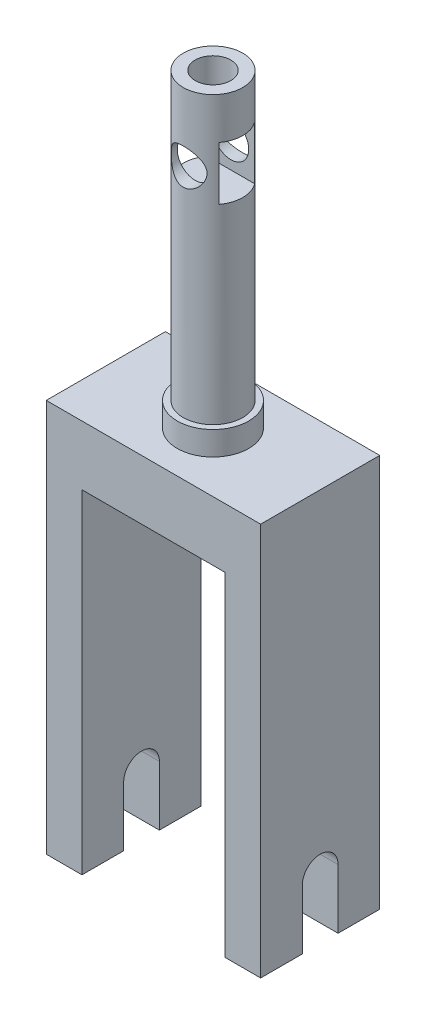
ISO-10303-21;
HEADER;
FILE_DESCRIPTION(('STEP AP214'),'2;1');
FILE_NAME('part.step','',(''),(''),'','','');
FILE_SCHEMA(('AUTOMOTIVE_DESIGN { 1 0 10303 214 1 1 1 1 }'));
ENDSEC;
DATA;
#1=APPLICATION_CONTEXT('core data for automotive mechanical design processes');
#2=APPLICATION_PROTOCOL_DEFINITION('international standard','automotive_design',2000,#1);
#3=PRODUCT_CONTEXT('',#1,'mechanical');
#4=PRODUCT('Part','Part','',(#3));
#5=PRODUCT_RELATED_PRODUCT_CATEGORY('part','',(#4));
#6=PRODUCT_DEFINITION_FORMATION('','',#4);
#7=PRODUCT_DEFINITION_CONTEXT('part definition',#1,'design');
#8=PRODUCT_DEFINITION('design','',#6,#7);
#9=PRODUCT_DEFINITION_SHAPE('','',#8);
#10=(LENGTH_UNIT() NAMED_UNIT(*) SI_UNIT(.MILLI.,.METRE.));
#11=(NAMED_UNIT(*) PLANE_ANGLE_UNIT() SI_UNIT($,.RADIAN.));
#12=(NAMED_UNIT(*) SI_UNIT($,.STERADIAN.) SOLID_ANGLE_UNIT());
#13=UNCERTAINTY_MEASURE_WITH_UNIT(LENGTH_MEASURE(1.E-05),#10,'distance_accuracy_value','');
#14=(GEOMETRIC_REPRESENTATION_CONTEXT(3) GLOBAL_UNCERTAINTY_ASSIGNED_CONTEXT((#13)) GLOBAL_UNIT_ASSIGNED_CONTEXT((#10,
#11,#12)) REPRESENTATION_CONTEXT('',''));
#15=CARTESIAN_POINT('',(0.,0.,0.));
#16=DIRECTION('',(0.,0.,1.));
#17=DIRECTION('',(1.,0.,0.));
#18=AXIS2_PLACEMENT_3D('',#15,#16,#17);
#19=CARTESIAN_POINT('',(-15.,30.4132586688075,6.5));
#20=DIRECTION('',(0.,1.,0.));
#21=DIRECTION('',(0.,0.,1.));
#22=AXIS2_PLACEMENT_3D('',#19,#20,#21);
#23=PLANE('',#22);
#24=DIRECTION('',(1.,0.,0.));
#25=VECTOR('',#24,1.);
#26=CARTESIAN_POINT('',(-15.,30.4132586688075,6.5));
#27=LINE('',#26,#25);
#28=CARTESIAN_POINT('',(-6.,30.4132586688075,6.5));
#29=VERTEX_POINT('',#28);
#30=CARTESIAN_POINT('',(-4.00000000000001,30.4132586688075,6.5));
#31=VERTEX_POINT('',#30);
#32=EDGE_CURVE('E185',#29,#31,#27,.T.);
#33=ORIENTED_EDGE('',*,*,#32,.F.);
#34=CARTESIAN_POINT('',(-6.,30.4132586688075,5.));
#35=DIRECTION('',(0.,1.,0.));
#36=DIRECTION('',(0.,0.,1.));
#37=AXIS2_PLACEMENT_3D('',#34,#35,#36);
#38=CIRCLE('',#37,1.5);
#39=CARTESIAN_POINT('',(-6.,30.4132586688075,3.5));
#40=VERTEX_POINT('',#39);
#41=EDGE_CURVE('E47',#40,#29,#38,.F.);
#42=ORIENTED_EDGE('',*,*,#41,.F.);
#43=DIRECTION('',(1.,0.,0.));
#44=VECTOR('',#43,1.);
#45=CARTESIAN_POINT('',(-15.,30.4132586688075,3.5));
#46=LINE('',#45,#44);
#47=CARTESIAN_POINT('',(-4.,30.4132586688075,3.5));
#48=VERTEX_POINT('',#47);
#49=EDGE_CURVE('E183',#40,#48,#46,.T.);
#50=ORIENTED_EDGE('',*,*,#49,.T.);
#51=CARTESIAN_POINT('',(-6.,30.4132586688075,5.));
#52=DIRECTION('',(0.,1.,0.));
#53=DIRECTION('',(0.,0.,1.));
#54=AXIS2_PLACEMENT_3D('',#51,#52,#53);
#55=CIRCLE('',#54,2.5);
#56=EDGE_CURVE('E41',#31,#48,#55,.T.);
#57=ORIENTED_EDGE('',*,*,#56,.F.);
#58=EDGE_LOOP('',(#33,#42,#50,#57));
#59=FACE_BOUND('',#58,.T.);
#60=ADVANCED_FACE('F32',(#59),#23,.F.);
#61=CARTESIAN_POINT('',(-6.,9.91325866880753,5.));
#62=DIRECTION('',(0.,1.,0.));
#63=DIRECTION('',(0.,0.,1.));
#64=AXIS2_PLACEMENT_3D('',#61,#62,#63);
#65=PLANE('',#64);
#66=CARTESIAN_POINT('',(-6.,9.91325866880753,5.));
#67=DIRECTION('',(0.,1.,0.));
#68=DIRECTION('',(0.,0.,1.));
#69=AXIS2_PLACEMENT_3D('',#66,#67,#68);
#70=CIRCLE('',#69,3.);
#71=CARTESIAN_POINT('',(-6.,9.91325866880753,8.));
#72=VERTEX_POINT('',#71);
#73=EDGE_CURVE('E211',#72,#72,#70,.T.);
#74=ORIENTED_EDGE('',*,*,#73,.T.);
#75=EDGE_LOOP('',(#74));
#76=FACE_BOUND('',#75,.T.);
#77=CARTESIAN_POINT('',(-6.,9.91325866880753,5.));
#78=DIRECTION('',(0.,1.,0.));
#79=DIRECTION('',(0.,0.,1.));
#80=AXIS2_PLACEMENT_3D('',#77,#78,#79);
#81=CIRCLE('',#80,2.5);
#82=CARTESIAN_POINT('',(-6.,9.91325866880753,7.5));
#83=VERTEX_POINT('',#82);
#84=EDGE_CURVE('E212',#83,#83,#81,.T.);
#85=ORIENTED_EDGE('',*,*,#84,.F.);
#86=EDGE_LOOP('',(#85));
#87=FACE_BOUND('',#86,.T.);
#88=ADVANCED_FACE('F366',(#76,#87),#65,.T.);
#89=CARTESIAN_POINT('',(-15.,7.91325866880753,10.));
#90=DIRECTION('',(0.,-1.,0.));
#91=DIRECTION('',(0.,0.,-1.));
#92=AXIS2_PLACEMENT_3D('',#89,#90,#91);
#93=PLANE('',#92);
#94=DIRECTION('',(-1.,0.,0.));
#95=VECTOR('',#94,1.);
#96=CARTESIAN_POINT('',(-15.,7.91325866880753,0.));
#97=LINE('',#96,#95);
#98=CARTESIAN_POINT('',(3.,7.91325866880753,0.));
#99=VERTEX_POINT('',#98);
#100=CARTESIAN_POINT('',(-15.,7.91325866880753,0.));
#101=VERTEX_POINT('',#100);
#102=EDGE_CURVE('E300',#99,#101,#97,.T.);
#103=ORIENTED_EDGE('',*,*,#102,.T.);
#104=DIRECTION('',(0.,0.,-1.));
#105=VECTOR('',#104,1.);
#106=CARTESIAN_POINT('',(-15.,7.91325866880753,10.));
#107=LINE('',#106,#105);
#108=CARTESIAN_POINT('',(-15.,7.91325866880753,10.));
#109=VERTEX_POINT('',#108);
#110=EDGE_CURVE('E307',#109,#101,#107,.T.);
#111=ORIENTED_EDGE('',*,*,#110,.F.);
#112=DIRECTION('',(-1.,0.,0.));
#113=VECTOR('',#112,1.);
#114=CARTESIAN_POINT('',(-15.,7.91325866880753,10.));
#115=LINE('',#114,#113);
#116=CARTESIAN_POINT('',(3.,7.91325866880753,10.));
#117=VERTEX_POINT('',#116);
#118=EDGE_CURVE('E281',#117,#109,#115,.T.);
#119=ORIENTED_EDGE('',*,*,#118,.F.);
#120=DIRECTION('',(0.,0.,-1.));
#121=VECTOR('',#120,1.);
#122=CARTESIAN_POINT('',(3.,7.91325866880753,10.));
#123=LINE('',#122,#121);
#124=EDGE_CURVE('E310',#117,#99,#123,.T.);
#125=ORIENTED_EDGE('',*,*,#124,.T.);
#126=EDGE_LOOP('',(#103,#111,#119,#125));
#127=FACE_BOUND('',#126,.T.);
#128=CARTESIAN_POINT('',(-6.,7.91325866880753,5.));
#129=DIRECTION('',(0.,-1.,0.));
#130=DIRECTION('',(0.,0.,-1.));
#131=AXIS2_PLACEMENT_3D('',#128,#129,#130);
#132=CIRCLE('',#131,3.);
#133=CARTESIAN_POINT('',(-6.,7.91325866880753,2.));
#134=VERTEX_POINT('',#133);
#135=EDGE_CURVE('E331',#134,#134,#132,.F.);
#136=ORIENTED_EDGE('',*,*,#135,.F.);
#137=EDGE_LOOP('',(#136));
#138=FACE_BOUND('',#137,.T.);
#139=ADVANCED_FACE('F370',(#127,#138),#93,.F.);
#140=CARTESIAN_POINT('',(-12.,-25.0867413311925,10.));
#141=DIRECTION('',(0.,1.,0.));
#142=DIRECTION('',(-1.,0.,0.));
#143=AXIS2_PLACEMENT_3D('',#140,#141,#142);
#144=PLANE('',#143);
#145=DIRECTION('',(0.,0.,-1.));
#146=VECTOR('',#145,1.);
#147=CARTESIAN_POINT('',(-12.,-25.0867413311925,10.));
#148=LINE('',#147,#146);
#149=CARTESIAN_POINT('',(-12.,-25.0867413311925,3.5));
#150=VERTEX_POINT('',#149);
#151=CARTESIAN_POINT('',(-12.,-25.0867413311925,0.));
#152=VERTEX_POINT('',#151);
#153=EDGE_CURVE('E327',#150,#152,#148,.T.);
#154=ORIENTED_EDGE('',*,*,#153,.F.);
#155=DIRECTION('',(1.,0.,0.));
#156=VECTOR('',#155,1.);
#157=CARTESIAN_POINT('',(-15.,-25.0867413311925,3.5));
#158=LINE('',#157,#156);
#159=CARTESIAN_POINT('',(-15.,-25.0867413311925,3.5));
#160=VERTEX_POINT('',#159);
#161=EDGE_CURVE('E239',#160,#150,#158,.T.);
#162=ORIENTED_EDGE('',*,*,#161,.F.);
#163=DIRECTION('',(0.,0.,-1.));
#164=VECTOR('',#163,1.);
#165=CARTESIAN_POINT('',(-15.,-25.0867413311925,10.));
#166=LINE('',#165,#164);
#167=CARTESIAN_POINT('',(-15.,-25.0867413311925,0.));
#168=VERTEX_POINT('',#167);
#169=EDGE_CURVE('E285',#160,#168,#166,.T.);
#170=ORIENTED_EDGE('',*,*,#169,.T.);
#171=DIRECTION('',(1.,0.,0.));
#172=VECTOR('',#171,1.);
#173=CARTESIAN_POINT('',(-12.,-25.0867413311925,0.));
#174=LINE('',#173,#172);
#175=EDGE_CURVE('E266',#168,#152,#174,.T.);
#176=ORIENTED_EDGE('',*,*,#175,.T.);
#177=EDGE_LOOP('',(#154,#162,#170,#176));
#178=FACE_BOUND('',#177,.T.);
#179=ADVANCED_FACE('F446',(#178),#144,.F.);
#180=CARTESIAN_POINT('',(3.,-25.0867413311925,10.));
#181=DIRECTION('',(0.,1.,0.));
#182=DIRECTION('',(0.,0.,1.));
#183=AXIS2_PLACEMENT_3D('',#180,#181,#182);
#184=PLANE('',#183);
#185=DIRECTION('',(0.,0.,-1.));
#186=VECTOR('',#185,1.);
#187=CARTESIAN_POINT('',(3.,-25.0867413311925,10.));
#188=LINE('',#187,#186);
#189=CARTESIAN_POINT('',(3.,-25.0867413311925,3.5));
#190=VERTEX_POINT('',#189);
#191=CARTESIAN_POINT('',(3.,-25.0867413311925,0.));
#192=VERTEX_POINT('',#191);
#193=EDGE_CURVE('E313',#190,#192,#188,.T.);
#194=ORIENTED_EDGE('',*,*,#193,.F.);
#195=CARTESIAN_POINT('',(0.,-25.0867413311925,3.5));
#196=VERTEX_POINT('',#195);
#197=EDGE_CURVE('E241',#196,#190,#158,.T.);
#198=ORIENTED_EDGE('',*,*,#197,.F.);
#199=DIRECTION('',(0.,0.,-1.));
#200=VECTOR('',#199,1.);
#201=CARTESIAN_POINT('',(0.,-25.0867413311925,10.));
#202=LINE('',#201,#200);
#203=CARTESIAN_POINT('',(0.,-25.0867413311925,0.));
#204=VERTEX_POINT('',#203);
#205=EDGE_CURVE('E317',#196,#204,#202,.T.);
#206=ORIENTED_EDGE('',*,*,#205,.T.);
#207=DIRECTION('',(1.,0.,0.));
#208=VECTOR('',#207,1.);
#209=CARTESIAN_POINT('',(3.,-25.0867413311925,0.));
#210=LINE('',#209,#208);
#211=EDGE_CURVE('E295',#204,#192,#210,.T.);
#212=ORIENTED_EDGE('',*,*,#211,.T.);
#213=EDGE_LOOP('',(#194,#198,#206,#212));
#214=FACE_BOUND('',#213,.T.);
#215=ADVANCED_FACE('F456',(#214),#184,.F.);
#216=CARTESIAN_POINT('',(-15.,-25.0867413311925,10.));
#217=VERTEX_POINT('',#216);
#218=CARTESIAN_POINT('',(-15.,-25.0867413311925,6.5));
#219=VERTEX_POINT('',#218);
#220=EDGE_CURVE('E304',#217,#219,#166,.T.);
#221=ORIENTED_EDGE('',*,*,#220,.T.);
#222=DIRECTION('',(1.,0.,0.));
#223=VECTOR('',#222,1.);
#224=CARTESIAN_POINT('',(-15.,-25.0867413311925,6.5));
#225=LINE('',#224,#223);
#226=CARTESIAN_POINT('',(-12.,-25.0867413311925,6.5));
#227=VERTEX_POINT('',#226);
#228=EDGE_CURVE('E242',#219,#227,#225,.T.);
#229=ORIENTED_EDGE('',*,*,#228,.T.);
#230=CARTESIAN_POINT('',(-12.,-25.0867413311925,10.));
#231=VERTEX_POINT('',#230);
#232=EDGE_CURVE('E328',#231,#227,#148,.T.);
#233=ORIENTED_EDGE('',*,*,#232,.F.);
#234=DIRECTION('',(1.,0.,0.));
#235=VECTOR('',#234,1.);
#236=CARTESIAN_POINT('',(-12.,-25.0867413311925,10.));
#237=LINE('',#236,#235);
#238=EDGE_CURVE('E267',#217,#231,#237,.T.);
#239=ORIENTED_EDGE('',*,*,#238,.F.);
#240=EDGE_LOOP('',(#221,#229,#233,#239));
#241=FACE_BOUND('',#240,.T.);
#242=ADVANCED_FACE('F34',(#241),#144,.F.);
#243=CARTESIAN_POINT('',(-12.,2.91325866880752,10.));
#244=DIRECTION('',(-1.,0.,0.));
#245=DIRECTION('',(0.,-1.,0.));
#246=AXIS2_PLACEMENT_3D('',#243,#244,#245);
#247=PLANE('',#246);
#248=CARTESIAN_POINT('',(-12.,-20.0867413311925,5.));
#249=DIRECTION('',(-1.,0.,0.));
#250=DIRECTION('',(0.,-1.,0.));
#251=AXIS2_PLACEMENT_3D('',#248,#249,#250);
#252=CIRCLE('',#251,1.5);
#253=CARTESIAN_POINT('',(-12.,-20.0867413311925,6.5));
#254=VERTEX_POINT('',#253);
#255=CARTESIAN_POINT('',(-12.,-20.0867413311925,3.5));
#256=VERTEX_POINT('',#255);
#257=EDGE_CURVE('E263',#254,#256,#252,.T.);
#258=ORIENTED_EDGE('',*,*,#257,.T.);
#259=DIRECTION('',(0.,-1.,0.));
#260=VECTOR('',#259,1.);
#261=CARTESIAN_POINT('',(-12.,2.91325866880752,3.5));
#262=LINE('',#261,#260);
#263=EDGE_CURVE('E257',#256,#150,#262,.T.);
#264=ORIENTED_EDGE('',*,*,#263,.T.);
#265=ORIENTED_EDGE('',*,*,#153,.T.);
#266=DIRECTION('',(0.,1.,0.));
#267=VECTOR('',#266,1.);
#268=CARTESIAN_POINT('',(-12.,2.91325866880752,0.));
#269=LINE('',#268,#267);
#270=CARTESIAN_POINT('',(-12.,2.91325866880752,0.));
#271=VERTEX_POINT('',#270);
#272=EDGE_CURVE('E288',#152,#271,#269,.T.);
#273=ORIENTED_EDGE('',*,*,#272,.T.);
#274=DIRECTION('',(0.,0.,-1.));
#275=VECTOR('',#274,1.);
#276=CARTESIAN_POINT('',(-12.,2.91325866880752,10.));
#277=LINE('',#276,#275);
#278=CARTESIAN_POINT('',(-12.,2.91325866880752,10.));
#279=VERTEX_POINT('',#278);
#280=EDGE_CURVE('E324',#279,#271,#277,.T.);
#281=ORIENTED_EDGE('',*,*,#280,.F.);
#282=DIRECTION('',(0.,1.,0.));
#283=VECTOR('',#282,1.);
#284=CARTESIAN_POINT('',(-12.,2.91325866880752,10.));
#285=LINE('',#284,#283);
#286=EDGE_CURVE('E270',#231,#279,#285,.T.);
#287=ORIENTED_EDGE('',*,*,#286,.F.);
#288=ORIENTED_EDGE('',*,*,#232,.T.);
#289=DIRECTION('',(0.,1.,0.));
#290=VECTOR('',#289,1.);
#291=CARTESIAN_POINT('',(-12.,2.91325866880752,6.5));
#292=LINE('',#291,#290);
#293=EDGE_CURVE('E251',#227,#254,#292,.T.);
#294=ORIENTED_EDGE('',*,*,#293,.T.);
#295=EDGE_LOOP('',(#258,#264,#265,#273,#281,#287,#288,#294));
#296=FACE_BOUND('',#295,.T.);
#297=ADVANCED_FACE('F462',(#296),#247,.F.);
#298=CARTESIAN_POINT('',(0.,2.91325866880753,10.));
#299=DIRECTION('',(0.,1.,0.));
#300=DIRECTION('',(-1.,0.,0.));
#301=AXIS2_PLACEMENT_3D('',#298,#299,#300);
#302=PLANE('',#301);
#303=DIRECTION('',(1.,0.,0.));
#304=VECTOR('',#303,1.);
#305=CARTESIAN_POINT('',(0.,2.91325866880753,0.));
#306=LINE('',#305,#304);
#307=CARTESIAN_POINT('',(0.,2.91325866880753,0.));
#308=VERTEX_POINT('',#307);
#309=EDGE_CURVE('E290',#271,#308,#306,.T.);
#310=ORIENTED_EDGE('',*,*,#309,.T.);
#311=DIRECTION('',(0.,0.,-1.));
#312=VECTOR('',#311,1.);
#313=CARTESIAN_POINT('',(0.,2.91325866880753,10.));
#314=LINE('',#313,#312);
#315=CARTESIAN_POINT('',(0.,2.91325866880753,10.));
#316=VERTEX_POINT('',#315);
#317=EDGE_CURVE('E321',#316,#308,#314,.T.);
#318=ORIENTED_EDGE('',*,*,#317,.F.);
#319=DIRECTION('',(1.,0.,0.));
#320=VECTOR('',#319,1.);
#321=CARTESIAN_POINT('',(0.,2.91325866880753,10.));
#322=LINE('',#321,#320);
#323=EDGE_CURVE('E273',#279,#316,#322,.T.);
#324=ORIENTED_EDGE('',*,*,#323,.F.);
#325=ORIENTED_EDGE('',*,*,#280,.T.);
#326=EDGE_LOOP('',(#310,#318,#324,#325));
#327=FACE_BOUND('',#326,.T.);
#328=ADVANCED_FACE('F459',(#327),#302,.F.);
#329=CARTESIAN_POINT('',(0.,-25.0867413311925,10.));
#330=DIRECTION('',(1.,0.,0.));
#331=DIRECTION('',(0.,0.,-1.));
#332=AXIS2_PLACEMENT_3D('',#329,#330,#331);
#333=PLANE('',#332);
#334=ORIENTED_EDGE('',*,*,#205,.F.);
#335=DIRECTION('',(0.,1.,0.));
#336=VECTOR('',#335,1.);
#337=CARTESIAN_POINT('',(0.,-25.0867413311925,3.5));
#338=LINE('',#337,#336);
#339=CARTESIAN_POINT('',(0.,-20.0867413311925,3.5));
#340=VERTEX_POINT('',#339);
#341=EDGE_CURVE('E254',#196,#340,#338,.T.);
#342=ORIENTED_EDGE('',*,*,#341,.T.);
#343=CARTESIAN_POINT('',(0.,-20.0867413311925,5.));
#344=DIRECTION('',(1.,0.,0.));
#345=DIRECTION('',(0.,0.,-1.));
#346=AXIS2_PLACEMENT_3D('',#343,#344,#345);
#347=CIRCLE('',#346,1.5);
#348=CARTESIAN_POINT('',(0.,-20.0867413311925,6.5));
#349=VERTEX_POINT('',#348);
#350=EDGE_CURVE('E260',#340,#349,#347,.T.);
#351=ORIENTED_EDGE('',*,*,#350,.T.);
#352=DIRECTION('',(0.,-1.,0.));
#353=VECTOR('',#352,1.);
#354=CARTESIAN_POINT('',(0.,-25.0867413311925,6.5));
#355=LINE('',#354,#353);
#356=CARTESIAN_POINT('',(0.,-25.0867413311925,6.5));
#357=VERTEX_POINT('',#356);
#358=EDGE_CURVE('E237',#349,#357,#355,.T.);
#359=ORIENTED_EDGE('',*,*,#358,.T.);
#360=CARTESIAN_POINT('',(0.,-25.0867413311925,10.));
#361=VERTEX_POINT('',#360);
#362=EDGE_CURVE('E318',#361,#357,#202,.T.);
#363=ORIENTED_EDGE('',*,*,#362,.F.);
#364=DIRECTION('',(0.,-1.,0.));
#365=VECTOR('',#364,1.);
#366=CARTESIAN_POINT('',(0.,-25.0867413311925,10.));
#367=LINE('',#366,#365);
#368=EDGE_CURVE('E275',#316,#361,#367,.T.);
#369=ORIENTED_EDGE('',*,*,#368,.F.);
#370=ORIENTED_EDGE('',*,*,#317,.T.);
#371=DIRECTION('',(0.,-1.,0.));
#372=VECTOR('',#371,1.);
#373=CARTESIAN_POINT('',(0.,-25.0867413311925,0.));
#374=LINE('',#373,#372);
#375=EDGE_CURVE('E292',#308,#204,#374,.T.);
#376=ORIENTED_EDGE('',*,*,#375,.T.);
#377=EDGE_LOOP('',(#334,#342,#351,#359,#363,#369,#370,#376));
#378=FACE_BOUND('',#377,.T.);
#379=ADVANCED_FACE('F454',(#378),#333,.F.);
#380=ORIENTED_EDGE('',*,*,#362,.T.);
#381=CARTESIAN_POINT('',(3.,-25.0867413311925,6.5));
#382=VERTEX_POINT('',#381);
#383=EDGE_CURVE('E245',#357,#382,#225,.T.);
#384=ORIENTED_EDGE('',*,*,#383,.T.);
#385=CARTESIAN_POINT('',(3.,-25.0867413311925,10.));
#386=VERTEX_POINT('',#385);
#387=EDGE_CURVE('E314',#386,#382,#188,.T.);
#388=ORIENTED_EDGE('',*,*,#387,.F.);
#389=DIRECTION('',(1.,0.,0.));
#390=VECTOR('',#389,1.);
#391=CARTESIAN_POINT('',(3.,-25.0867413311925,10.));
#392=LINE('',#391,#390);
#393=EDGE_CURVE('E277',#361,#386,#392,.T.);
#394=ORIENTED_EDGE('',*,*,#393,.F.);
#395=EDGE_LOOP('',(#380,#384,#388,#394));
#396=FACE_BOUND('',#395,.T.);
#397=ADVANCED_FACE('F450',(#396),#184,.F.);
#398=CARTESIAN_POINT('',(3.,7.91325866880753,10.));
#399=DIRECTION('',(-1.,0.,0.));
#400=DIRECTION('',(0.,-1.,0.));
#401=AXIS2_PLACEMENT_3D('',#398,#399,#400);
#402=PLANE('',#401);
#403=CARTESIAN_POINT('',(3.,-20.0867413311925,5.));
#404=DIRECTION('',(1.,0.,0.));
#405=DIRECTION('',(0.,1.,0.));
#406=AXIS2_PLACEMENT_3D('',#403,#404,#405);
#407=CIRCLE('',#406,1.5);
#408=CARTESIAN_POINT('',(3.,-20.0867413311925,3.5));
#409=VERTEX_POINT('',#408);
#410=CARTESIAN_POINT('',(3.,-20.0867413311925,6.5));
#411=VERTEX_POINT('',#410);
#412=EDGE_CURVE('E217',#409,#411,#407,.T.);
#413=ORIENTED_EDGE('',*,*,#412,.F.);
#414=DIRECTION('',(0.,1.,0.));
#415=VECTOR('',#414,1.);
#416=CARTESIAN_POINT('',(3.,-25.0867413311925,3.5));
#417=LINE('',#416,#415);
#418=EDGE_CURVE('E222',#190,#409,#417,.T.);
#419=ORIENTED_EDGE('',*,*,#418,.F.);
#420=ORIENTED_EDGE('',*,*,#193,.T.);
#421=DIRECTION('',(0.,1.,0.));
#422=VECTOR('',#421,1.);
#423=CARTESIAN_POINT('',(3.,7.91325866880753,0.));
#424=LINE('',#423,#422);
#425=EDGE_CURVE('E298',#192,#99,#424,.T.);
#426=ORIENTED_EDGE('',*,*,#425,.T.);
#427=ORIENTED_EDGE('',*,*,#124,.F.);
#428=DIRECTION('',(0.,1.,0.));
#429=VECTOR('',#428,1.);
#430=CARTESIAN_POINT('',(3.,7.91325866880753,10.));
#431=LINE('',#430,#429);
#432=EDGE_CURVE('E279',#386,#117,#431,.T.);
#433=ORIENTED_EDGE('',*,*,#432,.F.);
#434=ORIENTED_EDGE('',*,*,#387,.T.);
#435=DIRECTION('',(0.,-1.,0.));
#436=VECTOR('',#435,1.);
#437=CARTESIAN_POINT('',(3.,-20.0867413311925,6.5));
#438=LINE('',#437,#436);
#439=EDGE_CURVE('E230',#411,#382,#438,.T.);
#440=ORIENTED_EDGE('',*,*,#439,.F.);
#441=EDGE_LOOP('',(#413,#419,#420,#426,#427,#433,#434,#440));
#442=FACE_BOUND('',#441,.T.);
#443=ADVANCED_FACE('F442',(#442),#402,.F.);
#444=CARTESIAN_POINT('',(-15.,-25.0867413311925,10.));
#445=DIRECTION('',(1.,0.,0.));
#446=DIRECTION('',(0.,1.,0.));
#447=AXIS2_PLACEMENT_3D('',#444,#445,#446);
#448=PLANE('',#447);
#449=ORIENTED_EDGE('',*,*,#169,.F.);
#450=DIRECTION('',(0.,1.,0.));
#451=VECTOR('',#450,1.);
#452=CARTESIAN_POINT('',(-15.,-25.0867413311925,3.5));
#453=LINE('',#452,#451);
#454=CARTESIAN_POINT('',(-15.,-20.0867413311925,3.5));
#455=VERTEX_POINT('',#454);
#456=EDGE_CURVE('E225',#160,#455,#453,.T.);
#457=ORIENTED_EDGE('',*,*,#456,.T.);
#458=CARTESIAN_POINT('',(-15.,-20.0867413311925,5.));
#459=DIRECTION('',(1.,0.,0.));
#460=DIRECTION('',(0.,1.,0.));
#461=AXIS2_PLACEMENT_3D('',#458,#459,#460);
#462=CIRCLE('',#461,1.5);
#463=CARTESIAN_POINT('',(-15.,-20.0867413311925,6.5));
#464=VERTEX_POINT('',#463);
#465=EDGE_CURVE('E218',#455,#464,#462,.T.);
#466=ORIENTED_EDGE('',*,*,#465,.T.);
#467=DIRECTION('',(0.,-1.,0.));
#468=VECTOR('',#467,1.);
#469=CARTESIAN_POINT('',(-15.,-20.0867413311925,6.5));
#470=LINE('',#469,#468);
#471=EDGE_CURVE('E221',#464,#219,#470,.T.);
#472=ORIENTED_EDGE('',*,*,#471,.T.);
#473=ORIENTED_EDGE('',*,*,#220,.F.);
#474=DIRECTION('',(0.,-1.,0.));
#475=VECTOR('',#474,1.);
#476=CARTESIAN_POINT('',(-15.,-25.0867413311925,10.));
#477=LINE('',#476,#475);
#478=EDGE_CURVE('E283',#109,#217,#477,.T.);
#479=ORIENTED_EDGE('',*,*,#478,.F.);
#480=ORIENTED_EDGE('',*,*,#110,.T.);
#481=DIRECTION('',(0.,-1.,0.));
#482=VECTOR('',#481,1.);
#483=CARTESIAN_POINT('',(-15.,-25.0867413311925,0.));
#484=LINE('',#483,#482);
#485=EDGE_CURVE('E271',#101,#168,#484,.T.);
#486=ORIENTED_EDGE('',*,*,#485,.T.);
#487=EDGE_LOOP('',(#449,#457,#466,#472,#473,#479,#480,#486));
#488=FACE_BOUND('',#487,.T.);
#489=ADVANCED_FACE('F435',(#488),#448,.F.);
#490=CARTESIAN_POINT('',(-15.,-25.0867413311925,10.));
#491=DIRECTION('',(0.,0.,-1.));
#492=DIRECTION('',(-1.,0.,0.));
#493=AXIS2_PLACEMENT_3D('',#490,#491,#492);
#494=PLANE('',#493);
#495=ORIENTED_EDGE('',*,*,#238,.T.);
#496=ORIENTED_EDGE('',*,*,#286,.T.);
#497=ORIENTED_EDGE('',*,*,#323,.T.);
#498=ORIENTED_EDGE('',*,*,#368,.T.);
#499=ORIENTED_EDGE('',*,*,#393,.T.);
#500=ORIENTED_EDGE('',*,*,#432,.T.);
#501=ORIENTED_EDGE('',*,*,#118,.T.);
#502=ORIENTED_EDGE('',*,*,#478,.T.);
#503=EDGE_LOOP('',(#495,#496,#497,#498,#499,#500,#501,#502));
#504=FACE_BOUND('',#503,.T.);
#505=ADVANCED_FACE('F432',(#504),#494,.F.);
#506=CARTESIAN_POINT('',(-15.,-25.0867413311925,0.));
#507=DIRECTION('',(0.,0.,-1.));
#508=DIRECTION('',(-1.,0.,0.));
#509=AXIS2_PLACEMENT_3D('',#506,#507,#508);
#510=PLANE('',#509);
#511=ORIENTED_EDGE('',*,*,#175,.F.);
#512=ORIENTED_EDGE('',*,*,#485,.F.);
#513=ORIENTED_EDGE('',*,*,#102,.F.);
#514=ORIENTED_EDGE('',*,*,#425,.F.);
#515=ORIENTED_EDGE('',*,*,#211,.F.);
#516=ORIENTED_EDGE('',*,*,#375,.F.);
#517=ORIENTED_EDGE('',*,*,#309,.F.);
#518=ORIENTED_EDGE('',*,*,#272,.F.);
#519=EDGE_LOOP('',(#511,#512,#513,#514,#515,#516,#517,#518));
#520=FACE_BOUND('',#519,.T.);
#521=ADVANCED_FACE('F421',(#520),#510,.T.);
#522=CARTESIAN_POINT('',(-15.,-25.0867413311925,3.5));
#523=DIRECTION('',(0.,0.,-1.));
#524=DIRECTION('',(0.,1.,0.));
#525=AXIS2_PLACEMENT_3D('',#522,#523,#524);
#526=PLANE('',#525);
#527=DIRECTION('',(1.,0.,0.));
#528=VECTOR('',#527,1.);
#529=CARTESIAN_POINT('',(-15.,-20.0867413311925,3.5));
#530=LINE('',#529,#528);
#531=EDGE_CURVE('E234',#455,#256,#530,.T.);
#532=ORIENTED_EDGE('',*,*,#531,.F.);
#533=ORIENTED_EDGE('',*,*,#456,.F.);
#534=ORIENTED_EDGE('',*,*,#161,.T.);
#535=ORIENTED_EDGE('',*,*,#263,.F.);
#536=EDGE_LOOP('',(#532,#533,#534,#535));
#537=FACE_BOUND('',#536,.T.);
#538=ADVANCED_FACE('F417',(#537),#526,.F.);
#539=CARTESIAN_POINT('',(-15.,-20.0867413311925,6.5));
#540=DIRECTION('',(0.,0.,1.));
#541=DIRECTION('',(0.,-1.,0.));
#542=AXIS2_PLACEMENT_3D('',#539,#540,#541);
#543=PLANE('',#542);
#544=ORIENTED_EDGE('',*,*,#228,.F.);
#545=ORIENTED_EDGE('',*,*,#471,.F.);
#546=DIRECTION('',(1.,0.,0.));
#547=VECTOR('',#546,1.);
#548=CARTESIAN_POINT('',(-15.,-20.0867413311925,6.5));
#549=LINE('',#548,#547);
#550=EDGE_CURVE('E246',#464,#254,#549,.T.);
#551=ORIENTED_EDGE('',*,*,#550,.T.);
#552=ORIENTED_EDGE('',*,*,#293,.F.);
#553=EDGE_LOOP('',(#544,#545,#551,#552));
#554=FACE_BOUND('',#553,.T.);
#555=ADVANCED_FACE('F420',(#554),#543,.F.);
#556=CARTESIAN_POINT('',(-15.,-20.0867413311925,5.));
#557=DIRECTION('',(1.,0.,0.));
#558=DIRECTION('',(0.,1.,0.));
#559=AXIS2_PLACEMENT_3D('',#556,#557,#558);
#560=CYLINDRICAL_SURFACE('',#559,1.5);
#561=ORIENTED_EDGE('',*,*,#550,.F.);
#562=ORIENTED_EDGE('',*,*,#465,.F.);
#563=ORIENTED_EDGE('',*,*,#531,.T.);
#564=ORIENTED_EDGE('',*,*,#257,.F.);
#565=EDGE_LOOP('',(#561,#562,#563,#564));
#566=FACE_BOUND('',#565,.T.);
#567=ADVANCED_FACE('F426',(#566),#560,.F.);
#568=EDGE_CURVE('E238',#340,#409,#530,.T.);
#569=ORIENTED_EDGE('',*,*,#568,.T.);
#570=ORIENTED_EDGE('',*,*,#412,.T.);
#571=EDGE_CURVE('E228',#349,#411,#549,.T.);
#572=ORIENTED_EDGE('',*,*,#571,.F.);
#573=ORIENTED_EDGE('',*,*,#350,.F.);
#574=EDGE_LOOP('',(#569,#570,#572,#573));
#575=FACE_BOUND('',#574,.T.);
#576=ADVANCED_FACE('F430',(#575),#560,.F.);
#577=ORIENTED_EDGE('',*,*,#197,.T.);
#578=ORIENTED_EDGE('',*,*,#418,.T.);
#579=ORIENTED_EDGE('',*,*,#568,.F.);
#580=ORIENTED_EDGE('',*,*,#341,.F.);
#581=EDGE_LOOP('',(#577,#578,#579,#580));
#582=FACE_BOUND('',#581,.T.);
#583=ADVANCED_FACE('F423',(#582),#526,.F.);
#584=ORIENTED_EDGE('',*,*,#571,.T.);
#585=ORIENTED_EDGE('',*,*,#439,.T.);
#586=ORIENTED_EDGE('',*,*,#383,.F.);
#587=ORIENTED_EDGE('',*,*,#358,.F.);
#588=EDGE_LOOP('',(#584,#585,#586,#587));
#589=FACE_BOUND('',#588,.T.);
#590=ADVANCED_FACE('F415',(#589),#543,.F.);
#591=CARTESIAN_POINT('',(-6.,9.91325866880753,5.));
#592=DIRECTION('',(0.,-1.,0.));
#593=DIRECTION('',(0.,0.,-1.));
#594=AXIS2_PLACEMENT_3D('',#591,#592,#593);
#595=CYLINDRICAL_SURFACE('',#594,3.);
#596=ORIENTED_EDGE('',*,*,#73,.F.);
#597=EDGE_LOOP('',(#596));
#598=FACE_BOUND('',#597,.T.);
#599=ORIENTED_EDGE('',*,*,#135,.T.);
#600=EDGE_LOOP('',(#599));
#601=FACE_BOUND('',#600,.T.);
#602=ADVANCED_FACE('F409',(#598,#601),#595,.T.);
#603=CARTESIAN_POINT('',(-6.,33.9132586688075,5.));
#604=DIRECTION('',(0.,-1.,0.));
#605=DIRECTION('',(0.,0.,-1.));
#606=AXIS2_PLACEMENT_3D('',#603,#604,#605);
#607=CYLINDRICAL_SURFACE('',#606,2.5);
#608=CARTESIAN_POINT('',(-6.,29.6632586688075,2.5));
#609=CARTESIAN_POINT('',(-6.07672983346202,29.6632545777977,2.50000374210268));
#610=CARTESIAN_POINT('',(-6.15358232064418,29.6573299978813,2.5035709538499));
#611=CARTESIAN_POINT('',(-6.30497550953068,29.6339343492922,2.51750096391432));
#612=CARTESIAN_POINT('',(-6.37951003459605,29.6164348069533,2.52788051967281));
#613=CARTESIAN_POINT('',(-6.52375182779084,29.5708723076407,2.55438441945512));
#614=CARTESIAN_POINT('',(-6.59348102822657,29.5428617106444,2.57048026727056));
#615=CARTESIAN_POINT('',(-6.72703031821466,29.4773983356665,2.60704632373593));
#616=CARTESIAN_POINT('',(-6.79085186941638,29.4399479018388,2.62751544619745));
#617=CARTESIAN_POINT('',(-6.91629927899932,29.3534838420989,2.67294639280912));
#618=CARTESIAN_POINT('',(-6.97738402008142,29.3038049734561,2.69813207804015));
#619=CARTESIAN_POINT('',(-7.09088270411891,29.1957914649793,2.74969560720366));
#620=CARTESIAN_POINT('',(-7.14328534948112,29.1374457316202,2.77607494846429));
#621=CARTESIAN_POINT('',(-7.24444996762974,29.0053351583108,2.8308893300409));
#622=CARTESIAN_POINT('',(-7.29197766378809,28.9305568978262,2.85917982296351));
#623=CARTESIAN_POINT('',(-7.37361437764896,28.7724120955644,2.91061698587876));
#624=CARTESIAN_POINT('',(-7.4077451733516,28.68905977256,2.93377197726062));
#625=CARTESIAN_POINT('',(-7.45440601714222,28.5366622181543,2.9664537033907));
#626=CARTESIAN_POINT('',(-7.47016197246827,28.4690226701972,2.97792116862409));
#627=CARTESIAN_POINT('',(-7.49216172340475,28.3314549529772,2.99409691704497));
#628=CARTESIAN_POINT('',(-7.49841734556836,28.261529740053,2.9988136035624));
#629=CARTESIAN_POINT('',(-7.50105508796009,28.1212471745902,3.00079077536144));
#630=CARTESIAN_POINT('',(-7.49741783408419,28.0508892437143,2.99803662987282));
#631=CARTESIAN_POINT('',(-7.48046060478828,27.9119798933799,2.98546738556258));
#632=CARTESIAN_POINT('',(-7.46713334620103,27.8434298729601,2.97564697567774));
#633=CARTESIAN_POINT('',(-7.43173921881792,27.7107284266794,2.95046813055742));
#634=CARTESIAN_POINT('',(-7.40978748666087,27.646531614883,2.93518288347462));
#635=CARTESIAN_POINT('',(-7.35795061770837,27.5225636778794,2.90072948649171));
#636=CARTESIAN_POINT('',(-7.32806257259705,27.4627941853836,2.88155991376535));
#637=CARTESIAN_POINT('',(-7.25517983184583,27.3382745716847,2.83744672731015));
#638=CARTESIAN_POINT('',(-7.21080724397723,27.2744805758526,2.81207956627008));
#639=CARTESIAN_POINT('',(-7.11291092784003,27.1545821851405,2.76069400235619));
#640=CARTESIAN_POINT('',(-7.05937845100579,27.098485234831,2.73467499737851));
#641=CARTESIAN_POINT('',(-6.93581183438297,26.9876456869858,2.68064495041683));
#642=CARTESIAN_POINT('',(-6.86451768270496,26.9341813627915,2.65286163731468));
#643=CARTESIAN_POINT('',(-6.712276050459,26.8401366216096,2.60227571566019));
#644=CARTESIAN_POINT('',(-6.63133376394356,26.7995493150176,2.57947044574485));
#645=CARTESIAN_POINT('',(-6.46719758526821,26.7353264860116,2.54269607933849));
#646=CARTESIAN_POINT('',(-6.38446762417358,26.7107833130916,2.52826042560296));
#647=CARTESIAN_POINT('',(-6.21504789514464,26.6762474714021,2.50781157186449));
#648=CARTESIAN_POINT('',(-6.12836300566132,26.666237351054,2.50178827047262));
#649=CARTESIAN_POINT('',(-5.9662853856226,26.6617508211292,2.4990942962539));
#650=CARTESIAN_POINT('',(-5.89095752658128,26.6653498137224,2.50126478285714));
#651=CARTESIAN_POINT('',(-5.74217059801394,26.6836845218794,2.51221287912951));
#652=CARTESIAN_POINT('',(-5.6687114906239,26.6984200116133,2.52099035481963));
#653=CARTESIAN_POINT('',(-5.52742506784239,26.73780210162,2.5440520755781));
#654=CARTESIAN_POINT('',(-5.45950424907152,26.762199017881,2.55819724337445));
#655=CARTESIAN_POINT('',(-5.32873425091274,26.8199360451728,2.59086119137155));
#656=CARTESIAN_POINT('',(-5.26588607503609,26.8532779201542,2.60938083413489));
#657=CARTESIAN_POINT('',(-5.13999373717614,26.9318156480162,2.6515450376264));
#658=CARTESIAN_POINT('',(-5.07760584954316,26.9778824978859,2.6755219726012));
#659=CARTESIAN_POINT('',(-4.96097396868986,27.0786500622961,2.72525734425269));
#660=CARTESIAN_POINT('',(-4.90673959726262,27.1333608236601,2.7510178341364));
#661=CARTESIAN_POINT('',(-4.80068003264421,27.2581690588447,2.80554576090109));
#662=CARTESIAN_POINT('',(-4.75008980369085,27.329342554273,2.83426758253709));
#663=CARTESIAN_POINT('',(-4.66154761084333,27.4804746933757,2.8878381793329));
#664=CARTESIAN_POINT('',(-4.62358233230219,27.5604239627003,2.9126910200231));
#665=CARTESIAN_POINT('',(-4.56857421204224,27.7095016911142,2.95015090759481));
#666=CARTESIAN_POINT('',(-4.5487837466381,27.7772389811661,2.96424340671272));
#667=CARTESIAN_POINT('',(-4.51886336094028,27.9157907468876,2.98590394256456));
#668=CARTESIAN_POINT('',(-4.5087200470237,27.9866008131354,2.99348102357279));
#669=CARTESIAN_POINT('',(-4.49865869583369,28.1296356164046,3.00099553383732));
#670=CARTESIAN_POINT('',(-4.49877910892131,28.2018646594946,3.00090423554063));
#671=CARTESIAN_POINT('',(-4.50933527040673,28.345153104417,2.9930228210715));
#672=CARTESIAN_POINT('',(-4.51977662784242,28.4162118488881,2.9852285186118));
#673=CARTESIAN_POINT('',(-4.54959825851088,28.5517470863797,2.9636681475702));
#674=CARTESIAN_POINT('',(-4.56852363154649,28.6163757631144,2.95020788194419));
#675=CARTESIAN_POINT('',(-4.61436757923007,28.7415959232817,2.91894498039848));
#676=CARTESIAN_POINT('',(-4.64128916411521,28.8021858757681,2.90114070959518));
#677=CARTESIAN_POINT('',(-4.70710754444268,28.9275785260283,2.85987009449083));
#678=CARTESIAN_POINT('',(-4.74720832324248,28.9915997726618,2.8359541241736));
#679=CARTESIAN_POINT('',(-4.83624301610916,29.1126387414248,2.78679872969232));
#680=CARTESIAN_POINT('',(-4.88518420392202,29.1696506309601,2.76155822794979));
#681=CARTESIAN_POINT('',(-4.99990222574267,29.2846096179392,2.70774309708523));
#682=CARTESIAN_POINT('',(-5.0671231806861,29.3411897437037,2.67929691336342));
#683=CARTESIAN_POINT('',(-5.21153756555442,29.4423565246708,2.62634571127632));
#684=CARTESIAN_POINT('',(-5.28873455549847,29.4869388807923,2.60184210689064));
#685=CARTESIAN_POINT('',(-5.44887476919856,29.5610444763813,2.56014421345606));
#686=CARTESIAN_POINT('',(-5.5315699130428,29.5909867337344,2.54274922520213));
#687=CARTESIAN_POINT('',(-5.7020266938812,29.6359833640185,2.51633726998754));
#688=CARTESIAN_POINT('',(-5.7897679003514,29.6510938366645,2.50728874128515));
#689=CARTESIAN_POINT('',(-5.89844190308247,29.6599561235162,2.50197998831813));
#690=CARTESIAN_POINT('',(-5.91872374097173,29.6611930861136,2.50123885343638));
#691=CARTESIAN_POINT('',(-5.95933417931289,29.6628449151784,2.50024835482633));
#692=CARTESIAN_POINT('',(-5.97966278136243,29.6632597531284,2.49999900815684));
#693=CARTESIAN_POINT('',(-6.,29.6632586688075,2.5));
#694=B_SPLINE_CURVE_WITH_KNOTS('',3,(#608,#609,#610,#611,#612,#613,#614,#615,#616,#617,#618,
#619,#620,#621,#622,#623,#624,#625,#626,#627,#628,#629,#630,#631,#632,#633,#634,#635,#636,#637,
#638,#639,#640,#641,#642,#643,#644,#645,#646,#647,#648,#649,#650,#651,#652,#653,#654,#655,#656,
#657,#658,#659,#660,#661,#662,#663,#664,#665,#666,#667,#668,#669,#670,#671,#672,#673,#674,#675,
#676,#677,#678,#679,#680,#681,#682,#683,#684,#685,#686,#687,#688,#689,#690,#691,#692,#693),
.UNSPECIFIED.,.T.,.F.,(4,2,2,2,2,2,2,2,2,2,2,2,2,2,2,2,2,2,2,2,2,2,2,2,2,2,2,2,2,2,2,2,2,2,2,2,
2,2,2,2,2,2,4),(0.,0.230102237548649,0.460772627520012,0.690308884600009,0.919788197992273,
1.16681590732472,1.414162579348,1.69183813189807,1.96906040692092,2.17933829855633,
2.38935420916578,2.59978170870726,2.81036753273872,3.01823267593207,3.22617409809868,
3.47046995225162,3.71500044803674,3.99360957884691,4.27206939275324,4.5329679069656,
4.79355286918236,5.01875602722426,5.24395461863455,5.46367785689772,5.68344445659025,
5.92601365818362,6.16886690081836,6.44336762428009,6.71757792616456,6.93257787314693,
7.14727888733319,7.36278425777433,7.57840681155725,7.78364098331142,7.98895251523035,
8.22578610052286,8.46281544370208,8.73854311775519,9.01436946031986,9.28175654462678,
9.54812832184448,9.60911473335177,9.6701032602764),.UNSPECIFIED.);
#695=CARTESIAN_POINT('',(-6.,29.6632586688075,2.5));
#696=VERTEX_POINT('',#695);
#697=EDGE_CURVE('E391',#696,#696,#694,.T.);
#698=ORIENTED_EDGE('',*,*,#697,.T.);
#699=EDGE_LOOP('',(#698));
#700=FACE_BOUND('',#699,.T.);
#701=CARTESIAN_POINT('',(-4.5,28.1632586688075,7.));
#702=CARTESIAN_POINT('',(-4.49999595891409,28.0877796935179,6.99999416642511));
#703=CARTESIAN_POINT('',(-4.50573147175987,28.0123202347277,7.00433633903481));
#704=CARTESIAN_POINT('',(-4.52825034847213,27.8639347648453,7.02092590613883));
#705=CARTESIAN_POINT('',(-4.54504524211064,27.7910114814224,7.03318155043097));
#706=CARTESIAN_POINT('',(-4.58856513664205,27.6501750271302,7.0636233903473));
#707=CARTESIAN_POINT('',(-4.6152184549685,27.5822298307723,7.0817666618312));
#708=CARTESIAN_POINT('',(-4.67747090716981,27.4518212154396,7.12185904995836));
#709=CARTESIAN_POINT('',(-4.71307270945307,27.3893594391124,7.14380930122416));
#710=CARTESIAN_POINT('',(-4.79728707252356,27.2633096521434,7.19228594587542));
#711=CARTESIAN_POINT('',(-4.84695820564711,27.2005177116836,7.21904371037662));
#712=CARTESIAN_POINT('',(-4.95573198690016,27.0834939060658,7.27226229431061));
#713=CARTESIAN_POINT('',(-5.01484170327039,27.0292685171367,7.29872287517103));
#714=CARTESIAN_POINT('',(-5.1485576325883,26.9251248590978,7.35175567858734));
#715=CARTESIAN_POINT('',(-5.22414800483745,26.8763042051378,7.37803133577818));
#716=CARTESIAN_POINT('',(-5.38434577172834,26.7924489463631,7.42443786983179));
#717=CARTESIAN_POINT('',(-5.46894480337367,26.7574016946848,7.44457437988735));
#718=CARTESIAN_POINT('',(-5.63622859325733,26.7056627459949,7.4747098780044));
#719=CARTESIAN_POINT('',(-5.71832530186909,26.6875383078402,7.4854930393917));
#720=CARTESIAN_POINT('',(-5.88502949061729,26.6653158659444,7.49874939277545));
#721=CARTESIAN_POINT('',(-5.96963453759985,26.6612046908075,7.50123038813308));
#722=CARTESIAN_POINT('',(-6.12763728373731,26.66687241615,7.49783372711539));
#723=CARTESIAN_POINT('',(-6.20112383286564,26.6749921949768,7.49295437513726));
#724=CARTESIAN_POINT('',(-6.34546426915177,26.7017384644556,7.47707997553857));
#725=CARTESIAN_POINT('',(-6.4163179610512,26.7203657327147,7.46608447529309));
#726=CARTESIAN_POINT('',(-6.55405678046908,26.7674242315113,7.43884907201719));
#727=CARTESIAN_POINT('',(-6.62091649103762,26.7959117299465,7.42257910450824));
#728=CARTESIAN_POINT('',(-6.74898866011561,26.8616432850331,7.38609637638748));
#729=CARTESIAN_POINT('',(-6.81019964620801,26.8988896158665,7.36588259201812));
#730=CARTESIAN_POINT('',(-6.9330742671432,26.986097761612,7.32037925976363));
#731=CARTESIAN_POINT('',(-6.99391866319819,27.0370469805433,7.2947718295215));
#732=CARTESIAN_POINT('',(-7.10671465909275,27.1476627866677,7.24255554245601));
#733=CARTESIAN_POINT('',(-7.1586540130834,27.207341172282,7.21594536703375));
#734=CARTESIAN_POINT('',(-7.25824837767417,27.3419120749711,7.16111075123946));
#735=CARTESIAN_POINT('',(-7.30470933188632,27.417766245347,7.13305661385124));
#736=CARTESIAN_POINT('',(-7.38397217194232,27.5779649004441,7.08250879557267));
#737=CARTESIAN_POINT('',(-7.41679921962189,27.6622933849332,7.06000490298821));
#738=CARTESIAN_POINT('',(-7.46077497064843,27.8156523007029,7.02895865196731));
#739=CARTESIAN_POINT('',(-7.47527903312665,27.8832993011042,7.01833888618316));
#740=CARTESIAN_POINT('',(-7.49480872755284,28.020632279107,7.00392150777558));
#741=CARTESIAN_POINT('',(-7.49984538302907,28.0903157892921,7.00011596115116));
#742=CARTESIAN_POINT('',(-7.50014781114183,28.2298103512432,6.99988914321323));
#743=CARTESIAN_POINT('',(-7.49540004697659,28.2996214460227,7.00347810223984));
#744=CARTESIAN_POINT('',(-7.47640290574941,28.4372460125561,7.01751520788652));
#745=CARTESIAN_POINT('',(-7.4621460183014,28.5050578610478,7.02796877613213));
#746=CARTESIAN_POINT('',(-7.42488312618657,28.6369732482873,7.05431768333101));
#747=CARTESIAN_POINT('',(-7.40188805257362,28.7010813053398,7.07020622092812));
#748=CARTESIAN_POINT('',(-7.34796261057072,28.8247363845377,7.10571539417587));
#749=CARTESIAN_POINT('',(-7.31702924888212,28.8842816751735,7.12533743689999));
#750=CARTESIAN_POINT('',(-7.24167439558512,29.0084987513198,7.17036819177737));
#751=CARTESIAN_POINT('',(-7.19582663060302,29.0721595039041,7.19618239397369));
#752=CARTESIAN_POINT('',(-7.094873955187,29.191544153657,7.24821754803621));
#753=CARTESIAN_POINT('',(-7.03976018672402,29.2472603609766,7.27443886711455));
#754=CARTESIAN_POINT('',(-6.91327483721277,29.356482676158,7.32835625910913));
#755=CARTESIAN_POINT('',(-6.84072110878019,29.4087593954134,7.3558007587587));
#756=CARTESIAN_POINT('',(-6.68610310086802,29.5001614456442,7.40537639133459));
#757=CARTESIAN_POINT('',(-6.6040451761347,29.5392954966484,7.42751104449411));
#758=CARTESIAN_POINT('',(-6.43884023297214,29.6001268722389,7.46252280092775));
#759=CARTESIAN_POINT('',(-6.35620596365126,29.6228848965986,7.47595588067329));
#760=CARTESIAN_POINT('',(-6.18738306389086,29.6539732716538,7.494407389061));
#761=CARTESIAN_POINT('',(-6.10119857178197,29.6623199595251,7.49943534582737));
#762=CARTESIAN_POINT('',(-5.94018797679901,29.6639332773935,7.50040600461976));
#763=CARTESIAN_POINT('',(-5.86537941641029,29.6590620033706,7.49747057186327));
#764=CARTESIAN_POINT('',(-5.71785124402123,29.6383648444259,7.48512948412095));
#765=CARTESIAN_POINT('',(-5.64513165529809,29.6225388374859,7.47572375706639));
#766=CARTESIAN_POINT('',(-5.5048545180212,29.5810390972237,7.45149427526962));
#767=CARTESIAN_POINT('',(-5.43723296739117,29.5555270726783,7.43675966858906));
#768=CARTESIAN_POINT('',(-5.30721802800002,29.4956180742528,7.40303337447155));
#769=CARTESIAN_POINT('',(-5.24482581580017,29.4612191079479,7.38404073252268));
#770=CARTESIAN_POINT('',(-5.11973635470405,29.3803334722388,7.34093432659381));
#771=CARTESIAN_POINT('',(-5.05774130956006,29.3329399597907,7.31648844639149));
#772=CARTESIAN_POINT('',(-4.94210248463694,29.2295056350898,7.26601907350661));
#773=CARTESIAN_POINT('',(-4.88846809043084,29.1734552431996,7.23999385274509));
#774=CARTESIAN_POINT('',(-4.7840902464943,29.0459731066298,7.18528165666205));
#775=CARTESIAN_POINT('',(-4.73457593336633,28.973492182642,7.15667566270901));
#776=CARTESIAN_POINT('',(-4.64843182789675,28.819773816041,7.10376464485145));
#777=CARTESIAN_POINT('',(-4.61179533677339,28.7385409548261,7.07945738811052));
#778=CARTESIAN_POINT('',(-4.55562883464868,28.5761943836703,7.0408000304796));
#779=CARTESIAN_POINT('',(-4.53490473939813,28.4956634328463,7.02577665830138));
#780=CARTESIAN_POINT('',(-4.50710731759574,28.3311612741038,7.00539032320036));
#781=CARTESIAN_POINT('',(-4.50000449404164,28.2471979030488,7.00000648744643));
#782=CARTESIAN_POINT('',(-4.5,28.1632586688075,7.));
#783=B_SPLINE_CURVE_WITH_KNOTS('',3,(#701,#702,#703,#704,#705,#706,#707,#708,#709,#710,#711,
#712,#713,#714,#715,#716,#717,#718,#719,#720,#721,#722,#723,#724,#725,#726,#727,#728,#729,#730,
#731,#732,#733,#734,#735,#736,#737,#738,#739,#740,#741,#742,#743,#744,#745,#746,#747,#748,#749,
#750,#751,#752,#753,#754,#755,#756,#757,#758,#759,#760,#761,#762,#763,#764,#765,#766,#767,#768,
#769,#770,#771,#772,#773,#774,#775,#776,#777,#778,#779,#780,#781,#782),.UNSPECIFIED.,.T.,.F.,(4,
2,2,2,2,2,2,2,2,2,2,2,2,2,2,2,2,2,2,2,2,2,2,2,2,2,2,2,2,2,2,2,2,2,2,2,2,2,2,2,4),(0.,
0.226085249493393,0.45240657433077,0.677113624991876,0.90188776221593,1.15414462390001,
1.40659128601844,1.68630157736223,1.9657544327122,2.21853330858497,2.47107452602766,
2.69230130543182,2.91354445887945,3.13607155036376,3.35865648368878,3.60782810055849,
3.85733966656908,4.13576671140277,4.41367760154768,4.62276298054684,4.83160475643976,
5.04073566011182,5.25003193304128,5.45906724365495,5.66818149154661,5.91499438482002,
6.16204457978455,6.44121828011589,6.72020638384847,6.97891479383337,7.23732973022726,
7.46129321849399,7.68525920139648,7.90563970188756,8.12606965394584,8.37042963549487,
8.61506198741955,8.89071695766604,9.16622832484805,9.41820120134353,9.66962780912277),.UNSPECIFIED.);
#784=CARTESIAN_POINT('',(-4.5,28.1632586688075,7.));
#785=VERTEX_POINT('',#784);
#786=EDGE_CURVE('E394',#785,#785,#783,.T.);
#787=ORIENTED_EDGE('',*,*,#786,.T.);
#788=EDGE_LOOP('',(#787));
#789=FACE_BOUND('',#788,.T.);
#790=CARTESIAN_POINT('',(-6.,25.9132586688075,5.));
#791=DIRECTION('',(0.,-1.,0.));
#792=DIRECTION('',(0.,0.,-1.));
#793=AXIS2_PLACEMENT_3D('',#790,#791,#792);
#794=CIRCLE('',#793,2.5);
#795=CARTESIAN_POINT('',(-4.,25.9132586688075,3.5));
#796=VERTEX_POINT('',#795);
#797=CARTESIAN_POINT('',(-4.,25.9132586688075,6.5));
#798=VERTEX_POINT('',#797);
#799=EDGE_CURVE('E338',#796,#798,#794,.T.);
#800=ORIENTED_EDGE('',*,*,#799,.T.);
#801=DIRECTION('',(0.,-1.,0.));
#802=VECTOR('',#801,1.);
#803=CARTESIAN_POINT('',(-4.00000000000001,33.9132586688075,6.50000000000001));
#804=LINE('',#803,#802);
#805=EDGE_CURVE('E11',#798,#31,#804,.F.);
#806=ORIENTED_EDGE('',*,*,#805,.T.);
#807=ORIENTED_EDGE('',*,*,#56,.T.);
#808=DIRECTION('',(0.,-1.,0.));
#809=VECTOR('',#808,1.);
#810=CARTESIAN_POINT('',(-4.,33.9132586688075,3.5));
#811=LINE('',#810,#809);
#812=EDGE_CURVE('E196',#48,#796,#811,.T.);
#813=ORIENTED_EDGE('',*,*,#812,.T.);
#814=EDGE_LOOP('',(#800,#806,#807,#813));
#815=FACE_BOUND('',#814,.T.);
#816=CARTESIAN_POINT('',(-8.00000000000001,30.4132586688075,3.5));
#817=VERTEX_POINT('',#816);
#818=CARTESIAN_POINT('',(-8.,30.4132586688075,6.5));
#819=VERTEX_POINT('',#818);
#820=EDGE_CURVE('E202',#817,#819,#55,.T.);
#821=ORIENTED_EDGE('',*,*,#820,.T.);
#822=DIRECTION('',(0.,-1.,0.));
#823=VECTOR('',#822,1.);
#824=CARTESIAN_POINT('',(-8.,33.9132586688075,6.50000000000001));
#825=LINE('',#824,#823);
#826=CARTESIAN_POINT('',(-8.,25.9132586688075,6.5));
#827=VERTEX_POINT('',#826);
#828=EDGE_CURVE('E341',#819,#827,#825,.T.);
#829=ORIENTED_EDGE('',*,*,#828,.T.);
#830=CARTESIAN_POINT('',(-8.00000000000001,25.9132586688075,3.5));
#831=VERTEX_POINT('',#830);
#832=EDGE_CURVE('E334',#827,#831,#794,.T.);
#833=ORIENTED_EDGE('',*,*,#832,.T.);
#834=DIRECTION('',(0.,-1.,0.));
#835=VECTOR('',#834,1.);
#836=CARTESIAN_POINT('',(-8.00000000000001,33.9132586688075,3.5));
#837=LINE('',#836,#835);
#838=EDGE_CURVE('E337',#831,#817,#837,.F.);
#839=ORIENTED_EDGE('',*,*,#838,.T.);
#840=EDGE_LOOP('',(#821,#829,#833,#839));
#841=FACE_BOUND('',#840,.T.);
#842=CARTESIAN_POINT('',(-6.,33.9132586688075,5.));
#843=DIRECTION('',(0.,1.,0.));
#844=DIRECTION('',(0.,0.,1.));
#845=AXIS2_PLACEMENT_3D('',#842,#843,#844);
#846=CIRCLE('',#845,2.5);
#847=CARTESIAN_POINT('',(-6.,33.9132586688075,7.5));
#848=VERTEX_POINT('',#847);
#849=EDGE_CURVE('E208',#848,#848,#846,.T.);
#850=ORIENTED_EDGE('',*,*,#849,.F.);
#851=EDGE_LOOP('',(#850));
#852=FACE_BOUND('',#851,.T.);
#853=ORIENTED_EDGE('',*,*,#84,.T.);
#854=EDGE_LOOP('',(#853));
#855=FACE_BOUND('',#854,.T.);
#856=ADVANCED_FACE('F346',(#700,#789,#815,#841,#852,#855),#607,.T.);
#857=CARTESIAN_POINT('',(-6.,33.9132586688075,5.));
#858=DIRECTION('',(0.,1.,0.));
#859=DIRECTION('',(0.,0.,1.));
#860=AXIS2_PLACEMENT_3D('',#857,#858,#859);
#861=PLANE('',#860);
#862=CARTESIAN_POINT('',(-6.,33.9132586688075,5.));
#863=DIRECTION('',(0.,1.,0.));
#864=DIRECTION('',(0.,0.,1.));
#865=AXIS2_PLACEMENT_3D('',#862,#863,#864);
#866=CIRCLE('',#865,1.5);
#867=CARTESIAN_POINT('',(-6.,33.9132586688075,6.5));
#868=VERTEX_POINT('',#867);
#869=EDGE_CURVE('E187',#868,#868,#866,.T.);
#870=ORIENTED_EDGE('',*,*,#869,.F.);
#871=EDGE_LOOP('',(#870));
#872=FACE_BOUND('',#871,.T.);
#873=ORIENTED_EDGE('',*,*,#849,.T.);
#874=EDGE_LOOP('',(#873));
#875=FACE_BOUND('',#874,.T.);
#876=ADVANCED_FACE('F353',(#872,#875),#861,.T.);
#877=CARTESIAN_POINT('',(-15.,30.4132586688075,6.5));
#878=DIRECTION('',(0.,0.,1.));
#879=DIRECTION('',(0.,-1.,0.));
#880=AXIS2_PLACEMENT_3D('',#877,#878,#879);
#881=PLANE('',#880);
#882=CARTESIAN_POINT('',(-6.,28.1632586688075,6.5));
#883=DIRECTION('',(0.,0.,1.));
#884=DIRECTION('',(0.,-1.,0.));
#885=AXIS2_PLACEMENT_3D('',#882,#883,#884);
#886=CIRCLE('',#885,1.5);
#887=CARTESIAN_POINT('',(-6.,26.6632586688075,6.5));
#888=VERTEX_POINT('',#887);
#889=EDGE_CURVE('E679',#888,#888,#886,.T.);
#890=ORIENTED_EDGE('',*,*,#889,.T.);
#891=EDGE_LOOP('',(#890));
#892=FACE_BOUND('',#891,.T.);
#893=EDGE_CURVE('E203',#819,#29,#27,.T.);
#894=ORIENTED_EDGE('',*,*,#893,.T.);
#895=ORIENTED_EDGE('',*,*,#32,.T.);
#896=ORIENTED_EDGE('',*,*,#805,.F.);
#897=DIRECTION('',(1.,0.,0.));
#898=VECTOR('',#897,1.);
#899=CARTESIAN_POINT('',(-15.,25.9132586688075,6.5));
#900=LINE('',#899,#898);
#901=EDGE_CURVE('E55',#827,#798,#900,.T.);
#902=ORIENTED_EDGE('',*,*,#901,.F.);
#903=ORIENTED_EDGE('',*,*,#828,.F.);
#904=EDGE_LOOP('',(#894,#895,#896,#902,#903));
#905=FACE_BOUND('',#904,.T.);
#906=ADVANCED_FACE('F351',(#892,#905),#881,.F.);
#907=EDGE_CURVE('E192',#817,#40,#46,.T.);
#908=ORIENTED_EDGE('',*,*,#907,.T.);
#909=EDGE_CURVE('E173',#29,#40,#38,.F.);
#910=ORIENTED_EDGE('',*,*,#909,.F.);
#911=ORIENTED_EDGE('',*,*,#893,.F.);
#912=ORIENTED_EDGE('',*,*,#820,.F.);
#913=EDGE_LOOP('',(#908,#910,#911,#912));
#914=FACE_BOUND('',#913,.T.);
#915=ADVANCED_FACE('F200',(#914),#23,.F.);
#916=CARTESIAN_POINT('',(-15.,30.4132586688075,3.5));
#917=DIRECTION('',(0.,0.,-1.));
#918=DIRECTION('',(0.,1.,0.));
#919=AXIS2_PLACEMENT_3D('',#916,#917,#918);
#920=PLANE('',#919);
#921=CARTESIAN_POINT('',(-6.,28.1632586688075,3.5));
#922=DIRECTION('',(0.,0.,-1.));
#923=DIRECTION('',(0.,1.,0.));
#924=AXIS2_PLACEMENT_3D('',#921,#922,#923);
#925=CIRCLE('',#924,1.5);
#926=CARTESIAN_POINT('',(-6.,29.6632586688075,3.5));
#927=VERTEX_POINT('',#926);
#928=EDGE_CURVE('E36',#927,#927,#925,.T.);
#929=ORIENTED_EDGE('',*,*,#928,.T.);
#930=EDGE_LOOP('',(#929));
#931=FACE_BOUND('',#930,.T.);
#932=ORIENTED_EDGE('',*,*,#907,.F.);
#933=ORIENTED_EDGE('',*,*,#838,.F.);
#934=DIRECTION('',(1.,0.,0.));
#935=VECTOR('',#934,1.);
#936=CARTESIAN_POINT('',(-15.,25.9132586688075,3.5));
#937=LINE('',#936,#935);
#938=EDGE_CURVE('E198',#831,#796,#937,.T.);
#939=ORIENTED_EDGE('',*,*,#938,.T.);
#940=ORIENTED_EDGE('',*,*,#812,.F.);
#941=ORIENTED_EDGE('',*,*,#49,.F.);
#942=EDGE_LOOP('',(#932,#933,#939,#940,#941));
#943=FACE_BOUND('',#942,.T.);
#944=ADVANCED_FACE('F190',(#931,#943),#920,.F.);
#945=CARTESIAN_POINT('',(-15.,25.9132586688075,6.5));
#946=DIRECTION('',(0.,-1.,0.));
#947=DIRECTION('',(0.,0.,-1.));
#948=AXIS2_PLACEMENT_3D('',#945,#946,#947);
#949=PLANE('',#948);
#950=ORIENTED_EDGE('',*,*,#938,.F.);
#951=ORIENTED_EDGE('',*,*,#832,.F.);
#952=ORIENTED_EDGE('',*,*,#901,.T.);
#953=ORIENTED_EDGE('',*,*,#799,.F.);
#954=EDGE_LOOP('',(#950,#951,#952,#953));
#955=FACE_BOUND('',#954,.T.);
#956=ADVANCED_FACE('F348',(#955),#949,.F.);
#957=CARTESIAN_POINT('',(-6.,-25.0877413311925,5.));
#958=DIRECTION('',(0.,1.,0.));
#959=DIRECTION('',(0.,0.,1.));
#960=AXIS2_PLACEMENT_3D('',#957,#958,#959);
#961=CYLINDRICAL_SURFACE('',#960,1.5);
#962=ORIENTED_EDGE('',*,*,#869,.T.);
#963=EDGE_LOOP('',(#962));
#964=FACE_BOUND('',#963,.T.);
#965=ORIENTED_EDGE('',*,*,#909,.T.);
#966=ORIENTED_EDGE('',*,*,#41,.T.);
#967=EDGE_LOOP('',(#965,#966));
#968=FACE_BOUND('',#967,.T.);
#969=ADVANCED_FACE('F174',(#964,#968),#961,.F.);
#970=CARTESIAN_POINT('',(-6.,28.1632586688075,0.));
#971=DIRECTION('',(0.,0.,1.));
#972=DIRECTION('',(1.,0.,0.));
#973=AXIS2_PLACEMENT_3D('',#970,#971,#972);
#974=CYLINDRICAL_SURFACE('',#973,1.5);
#975=ORIENTED_EDGE('',*,*,#928,.F.);
#976=EDGE_LOOP('',(#975));
#977=FACE_BOUND('',#976,.T.);
#978=ORIENTED_EDGE('',*,*,#697,.F.);
#979=EDGE_LOOP('',(#978));
#980=FACE_BOUND('',#979,.T.);
#981=ADVANCED_FACE('F382',(#977,#980),#974,.F.);
#982=ORIENTED_EDGE('',*,*,#889,.F.);
#983=EDGE_LOOP('',(#982));
#984=FACE_BOUND('',#983,.T.);
#985=ORIENTED_EDGE('',*,*,#786,.F.);
#986=EDGE_LOOP('',(#985));
#987=FACE_BOUND('',#986,.T.);
#988=ADVANCED_FACE('F387',(#984,#987),#974,.F.);
#989=CLOSED_SHELL('',(#60,#88,#139,#179,#215,#242,#297,#328,#379,#397,#443,#489,#505,#521,#538,
#555,#567,#576,#583,#590,#602,#856,#876,#906,#915,#944,#956,#969,#981,#988));
#990=MANIFOLD_SOLID_BREP('B2',#989);
#991=ADVANCED_BREP_SHAPE_REPRESENTATION('',(#18,#990),#14);
#992=SHAPE_DEFINITION_REPRESENTATION(#9,#991);
ENDSEC;
END-ISO-10303-21;
